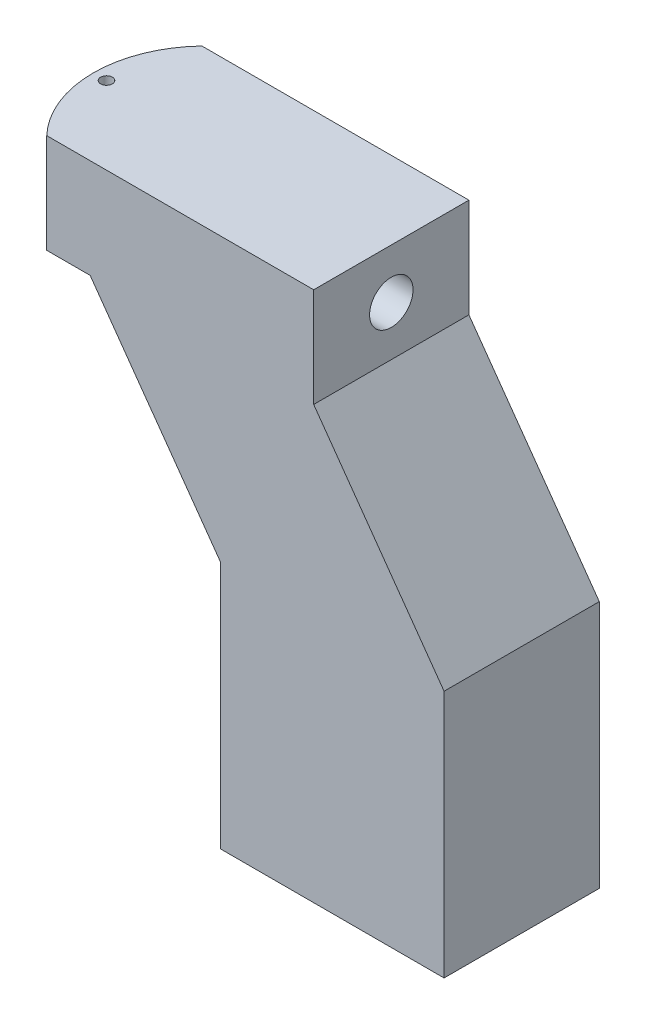
ISO-10303-21;
HEADER;
FILE_DESCRIPTION(('STEP AP214'),'2;1');
FILE_NAME('part.step','',(''),(''),'','','');
FILE_SCHEMA(('AUTOMOTIVE_DESIGN { 1 0 10303 214 1 1 1 1 }'));
ENDSEC;
DATA;
#1=APPLICATION_CONTEXT('core data for automotive mechanical design processes');
#2=APPLICATION_PROTOCOL_DEFINITION('international standard','automotive_design',2000,#1);
#3=PRODUCT_CONTEXT('',#1,'mechanical');
#4=PRODUCT('Part','Part','',(#3));
#5=PRODUCT_RELATED_PRODUCT_CATEGORY('part','',(#4));
#6=PRODUCT_DEFINITION_FORMATION('','',#4);
#7=PRODUCT_DEFINITION_CONTEXT('part definition',#1,'design');
#8=PRODUCT_DEFINITION('design','',#6,#7);
#9=PRODUCT_DEFINITION_SHAPE('','',#8);
#10=(LENGTH_UNIT() NAMED_UNIT(*) SI_UNIT(.MILLI.,.METRE.));
#11=(NAMED_UNIT(*) PLANE_ANGLE_UNIT() SI_UNIT($,.RADIAN.));
#12=(NAMED_UNIT(*) SI_UNIT($,.STERADIAN.) SOLID_ANGLE_UNIT());
#13=UNCERTAINTY_MEASURE_WITH_UNIT(LENGTH_MEASURE(1.E-05),#10,'distance_accuracy_value','');
#14=(GEOMETRIC_REPRESENTATION_CONTEXT(3) GLOBAL_UNCERTAINTY_ASSIGNED_CONTEXT((#13)) GLOBAL_UNIT_ASSIGNED_CONTEXT((#10,
#11,#12)) REPRESENTATION_CONTEXT('',''));
#15=CARTESIAN_POINT('',(0.,0.,0.));
#16=DIRECTION('',(0.,0.,1.));
#17=DIRECTION('',(1.,0.,0.));
#18=AXIS2_PLACEMENT_3D('',#15,#16,#17);
#19=CARTESIAN_POINT('',(0.54102,-21.717,-3.175));
#20=DIRECTION('',(0.,1.,0.));
#21=DIRECTION('',(0.,0.,1.));
#22=AXIS2_PLACEMENT_3D('',#19,#20,#21);
#23=CYLINDRICAL_SURFACE('',#22,0.24003);
#24=CARTESIAN_POINT('',(0.54102,-2.88798282640482,-2.93497));
#25=CARTESIAN_POINT('',(0.554236155346885,-2.88798304927932,-2.93497030590419));
#26=CARTESIAN_POINT('',(0.567455521073122,-2.88829225422702,-2.93606524919866));
#27=CARTESIAN_POINT('',(0.593512028196118,-2.88949184994874,-2.94040751217706));
#28=CARTESIAN_POINT('',(0.606348980940187,-2.89038252276682,-2.94365587640105));
#29=CARTESIAN_POINT('',(0.631259939306122,-2.89263699007009,-2.95219005837392));
#30=CARTESIAN_POINT('',(0.643335007455443,-2.89400010763483,-2.95747296222484));
#31=CARTESIAN_POINT('',(0.666429458001008,-2.89704500716515,-2.96991708587478));
#32=CARTESIAN_POINT('',(0.677448750745898,-2.89872681615643,-2.9770784649922));
#33=CARTESIAN_POINT('',(0.698401386507804,-2.90226792469828,-2.99327262063795));
#34=CARTESIAN_POINT('',(0.708303651502453,-2.90413043388217,-3.00234491370661));
#35=CARTESIAN_POINT('',(0.726466214500858,-2.90779540972771,-3.0220184095594));
#36=CARTESIAN_POINT('',(0.734726338646097,-2.909597870015,-3.03261977402623));
#37=CARTESIAN_POINT('',(0.749500246765532,-2.91297553679467,-3.05526650853636));
#38=CARTESIAN_POINT('',(0.755983058918322,-2.91454651588914,-3.06733276877076));
#39=CARTESIAN_POINT('',(0.766816204961666,-2.91724734234072,-3.09243349359592));
#40=CARTESIAN_POINT('',(0.771166907835945,-2.91837726602017,-3.10546779020797));
#41=CARTESIAN_POINT('',(0.777511537734915,-2.92004597333891,-3.13181012606058));
#42=CARTESIAN_POINT('',(0.779558348415593,-2.92059800029529,-3.14510457444581));
#43=CARTESIAN_POINT('',(0.781403553653398,-2.92109505102219,-3.17185884974813));
#44=CARTESIAN_POINT('',(0.781202333632343,-2.92104017884475,-3.18531864792096));
#45=CARTESIAN_POINT('',(0.778594264958931,-2.92033928485342,-3.21165318185209));
#46=CARTESIAN_POINT('',(0.776244564484611,-2.91970858044684,-3.2245340474229));
#47=CARTESIAN_POINT('',(0.769498656561043,-2.9179450141524,-3.24971138064662));
#48=CARTESIAN_POINT('',(0.765102330965124,-2.91681212327471,-3.26200781451653));
#49=CARTESIAN_POINT('',(0.754344663558499,-2.91414890480294,-3.28581216083852));
#50=CARTESIAN_POINT('',(0.747963896286324,-2.91261467322094,-3.29731083979259));
#51=CARTESIAN_POINT('',(0.733433421680396,-2.90931384178809,-3.31909362003446));
#52=CARTESIAN_POINT('',(0.725283362071803,-2.90754719569001,-3.32937747881501));
#53=CARTESIAN_POINT('',(0.7071429271749,-2.90390720504817,-3.34877982977216));
#54=CARTESIAN_POINT('',(0.697102733973296,-2.90203225223646,-3.3578514977004));
#55=CARTESIAN_POINT('',(0.675624214691467,-2.89843695238078,-3.37419392038059));
#56=CARTESIAN_POINT('',(0.664185798943297,-2.89671661526461,-3.38146455954206));
#57=CARTESIAN_POINT('',(0.640131958131012,-2.89361875050004,-3.39403539250862));
#58=CARTESIAN_POINT('',(0.627509407542544,-2.89224350897601,-3.39932255504969));
#59=CARTESIAN_POINT('',(0.601508114569176,-2.89001979704997,-3.40768424101559));
#60=CARTESIAN_POINT('',(0.588129566095029,-2.88917119223065,-3.41075932907611));
#61=CARTESIAN_POINT('',(0.561434705262119,-2.88812555715638,-3.41452821587451));
#62=CARTESIAN_POINT('',(0.54812901123588,-2.8879093867914,-3.41529198997773));
#63=CARTESIAN_POINT('',(0.521579967359251,-2.88810067493571,-3.41460961402));
#64=CARTESIAN_POINT('',(0.508336610842855,-2.88850806517223,-3.4131637058941));
#65=CARTESIAN_POINT('',(0.482559852530964,-2.88988205482609,-3.40816476297735));
#66=CARTESIAN_POINT('',(0.470017580745107,-2.89083740723587,-3.40465407239828));
#67=CARTESIAN_POINT('',(0.445699968198564,-2.89318862578999,-3.39567297086049));
#68=CARTESIAN_POINT('',(0.433924729687759,-2.89458455052071,-3.39020229925445));
#69=CARTESIAN_POINT('',(0.411183451020988,-2.89769870546514,-3.37731536669439));
#70=CARTESIAN_POINT('',(0.400241524583361,-2.89942347030609,-3.36985816865452));
#71=CARTESIAN_POINT('',(0.379738655464769,-2.90298572524511,-3.35326040337695));
#72=CARTESIAN_POINT('',(0.370177979791198,-2.90482323704058,-3.34411951144191));
#73=CARTESIAN_POINT('',(0.352417058118375,-2.90847004982539,-3.32408965474099));
#74=CARTESIAN_POINT('',(0.344265689332868,-2.91027688931907,-3.31315681088722));
#75=CARTESIAN_POINT('',(0.329913734080422,-2.91360283565777,-3.29003748934709));
#76=CARTESIAN_POINT('',(0.323713043749413,-2.9151219578206,-3.27785107845289));
#77=CARTESIAN_POINT('',(0.31349587668051,-2.91769151060252,-3.25265633361758));
#78=CARTESIAN_POINT('',(0.309463018227467,-2.91874544534803,-3.2396550176376));
#79=CARTESIAN_POINT('',(0.303648866859619,-2.92028130753035,-3.21312643344988));
#80=CARTESIAN_POINT('',(0.301867061453265,-2.92076336516344,-3.19959928568008));
#81=CARTESIAN_POINT('',(0.300638370979028,-2.92109483913859,-3.17285915654959));
#82=CARTESIAN_POINT('',(0.301119873568206,-2.92096365938954,-3.15964966027298));
#83=CARTESIAN_POINT('',(0.304237386803346,-2.92012745551242,-3.1335069641994));
#84=CARTESIAN_POINT('',(0.306873312897095,-2.91942245390449,-3.12057375357979));
#85=CARTESIAN_POINT('',(0.314183953161725,-2.91752184165393,-3.09543919178653));
#86=CARTESIAN_POINT('',(0.318843814343235,-2.91632980888199,-3.08323323194778));
#87=CARTESIAN_POINT('',(0.330056807457022,-2.91357962181077,-3.0597694669318));
#88=CARTESIAN_POINT('',(0.336610210000164,-2.91202141518659,-3.0485117975744));
#89=CARTESIAN_POINT('',(0.351632031656856,-2.9086524415465,-3.02693209952352));
#90=CARTESIAN_POINT('',(0.3601476954816,-2.90683595720231,-3.01664385382845));
#91=CARTESIAN_POINT('',(0.378763144175126,-2.90317779336287,-2.99761817848437));
#92=CARTESIAN_POINT('',(0.388863348763383,-2.90133610731041,-2.98888116104175));
#93=CARTESIAN_POINT('',(0.410637004942681,-2.89778780701891,-2.97300926350235));
#94=CARTESIAN_POINT('',(0.422340968926928,-2.89608520874053,-2.96591526158963));
#95=CARTESIAN_POINT('',(0.446820001192829,-2.89306518411297,-2.95380561677744));
#96=CARTESIAN_POINT('',(0.459594379416334,-2.89174751203666,-2.94878864709603));
#97=CARTESIAN_POINT('',(0.483766750401434,-2.88982461418773,-2.94161323741973));
#98=CARTESIAN_POINT('',(0.495062410982024,-2.88913961625142,-2.93912796319939));
#99=CARTESIAN_POINT('',(0.517911250446445,-2.88821865203579,-2.93580631031179));
#100=CARTESIAN_POINT('',(0.529464398063099,-2.88798263153355,-2.93496973253136));
#101=CARTESIAN_POINT('',(0.54102,-2.88798282640482,-2.93497));
#102=B_SPLINE_CURVE_WITH_KNOTS('',3,(#24,#25,#26,#27,#28,#29,#30,#31,#32,#33,#34,#35,#36,#37,
#38,#39,#40,#41,#42,#43,#44,#45,#46,#47,#48,#49,#50,#51,#52,#53,#54,#55,#56,#57,#58,#59,#60,#61,
#62,#63,#64,#65,#66,#67,#68,#69,#70,#71,#72,#73,#74,#75,#76,#77,#78,#79,#80,#81,#82,#83,#84,#85,
#86,#87,#88,#89,#90,#91,#92,#93,#94,#95,#96,#97,#98,#99,#100,#101),.UNSPECIFIED.,.T.,.F.,(4,2,2,
2,2,2,2,2,2,2,2,2,2,2,2,2,2,2,2,2,2,2,2,2,2,2,2,2,2,2,2,2,2,2,2,2,2,2,4),(0.,0.0396059620935172,
0.0792311495569324,0.118799795032823,0.158371797514894,0.198860704906883,0.239353896704178,
0.280513388415694,0.321665754530682,0.361852911757495,0.402033179056405,0.441174818753102,
0.480318718281323,0.519858540090494,0.559406241705615,0.600197755160072,0.640991885946086,
0.682049522542666,0.723096675387109,0.762888023024411,0.802675014274361,0.841673189095263,
0.88067655199966,0.92055590377599,0.960442954281112,1.00151545838151,1.04258577520202,
1.08334120896987,1.12408736237818,1.16355312182914,1.2030173324866,1.242196696428,
1.28138166236484,1.32163257829637,1.36189417410894,1.40306986059721,1.44421920384151,
1.47885302912955,1.51348267143233),.UNSPECIFIED.);
#103=CARTESIAN_POINT('',(0.54102,-2.88798282640482,-2.93497));
#104=VERTEX_POINT('',#103);
#105=EDGE_CURVE('E193',#104,#104,#102,.T.);
#106=ORIENTED_EDGE('',*,*,#105,.T.);
#107=EDGE_LOOP('',(#106));
#108=FACE_BOUND('',#107,.T.);
#109=CARTESIAN_POINT('',(0.54102,-4.064,-3.175));
#110=DIRECTION('',(0.,-1.,0.));
#111=DIRECTION('',(0.,0.,-1.));
#112=AXIS2_PLACEMENT_3D('',#109,#110,#111);
#113=CIRCLE('',#112,0.24003);
#114=CARTESIAN_POINT('',(0.54102,-4.064,-3.41503));
#115=VERTEX_POINT('',#114);
#116=EDGE_CURVE('E183',#115,#115,#113,.T.);
#117=ORIENTED_EDGE('',*,*,#116,.T.);
#118=EDGE_LOOP('',(#117));
#119=FACE_BOUND('',#118,.T.);
#120=ADVANCED_FACE('F41',(#108,#119),#23,.F.);
#121=CARTESIAN_POINT('',(0.,0.,-6.35));
#122=DIRECTION('',(0.,1.,0.));
#123=DIRECTION('',(0.,0.,1.));
#124=AXIS2_PLACEMENT_3D('',#121,#122,#123);
#125=PLANE('',#124);
#126=CARTESIAN_POINT('',(0.54102,0.,-3.175));
#127=DIRECTION('',(0.,1.,0.));
#128=DIRECTION('',(0.,0.,1.));
#129=AXIS2_PLACEMENT_3D('',#126,#127,#128);
#130=CIRCLE('',#129,0.24003);
#131=CARTESIAN_POINT('',(0.54102,0.,-2.93497));
#132=VERTEX_POINT('',#131);
#133=EDGE_CURVE('E186',#132,#132,#130,.T.);
#134=ORIENTED_EDGE('',*,*,#133,.F.);
#135=EDGE_LOOP('',(#134));
#136=FACE_BOUND('',#135,.T.);
#137=CARTESIAN_POINT('',(4.60375,0.,-3.175));
#138=DIRECTION('',(0.,-1.,0.));
#139=DIRECTION('',(0.,0.,1.));
#140=AXIS2_PLACEMENT_3D('',#137,#138,#139);
#141=CIRCLE('',#140,4.60375);
#142=CARTESIAN_POINT('',(1.27,0.,0.));
#143=VERTEX_POINT('',#142);
#144=CARTESIAN_POINT('',(1.27,0.,-6.35));
#145=VERTEX_POINT('',#144);
#146=EDGE_CURVE('E207',#143,#145,#141,.T.);
#147=ORIENTED_EDGE('',*,*,#146,.F.);
#148=DIRECTION('',(-1.,0.,0.));
#149=VECTOR('',#148,1.);
#150=CARTESIAN_POINT('',(0.,0.,0.));
#151=LINE('',#150,#149);
#152=CARTESIAN_POINT('',(12.192,0.,0.));
#153=VERTEX_POINT('',#152);
#154=EDGE_CURVE('E172',#153,#143,#151,.T.);
#155=ORIENTED_EDGE('',*,*,#154,.F.);
#156=DIRECTION('',(0.,0.,1.));
#157=VECTOR('',#156,1.);
#158=CARTESIAN_POINT('',(12.192,0.,-6.35));
#159=LINE('',#158,#157);
#160=CARTESIAN_POINT('',(12.192,0.,-6.35));
#161=VERTEX_POINT('',#160);
#162=EDGE_CURVE('E70',#161,#153,#159,.T.);
#163=ORIENTED_EDGE('',*,*,#162,.F.);
#164=DIRECTION('',(-1.,0.,0.));
#165=VECTOR('',#164,1.);
#166=CARTESIAN_POINT('',(0.,0.,-6.35));
#167=LINE('',#166,#165);
#168=EDGE_CURVE('E153',#161,#145,#167,.T.);
#169=ORIENTED_EDGE('',*,*,#168,.T.);
#170=EDGE_LOOP('',(#147,#155,#163,#169));
#171=FACE_BOUND('',#170,.T.);
#172=ADVANCED_FACE('F235',(#136,#171),#125,.T.);
#173=CARTESIAN_POINT('',(12.192,0.,-6.35));
#174=DIRECTION('',(1.,0.,0.));
#175=DIRECTION('',(0.,0.,-1.));
#176=AXIS2_PLACEMENT_3D('',#173,#174,#175);
#177=PLANE('',#176);
#178=CARTESIAN_POINT('',(12.192,-2.032,-3.175));
#179=DIRECTION('',(1.,0.,0.));
#180=DIRECTION('',(0.,0.,-1.));
#181=AXIS2_PLACEMENT_3D('',#178,#179,#180);
#182=CIRCLE('',#181,0.888999999999987);
#183=CARTESIAN_POINT('',(12.192,-2.032,-4.06399999999999));
#184=VERTEX_POINT('',#183);
#185=EDGE_CURVE('E294',#184,#184,#182,.T.);
#186=ORIENTED_EDGE('',*,*,#185,.F.);
#187=EDGE_LOOP('',(#186));
#188=FACE_BOUND('',#187,.T.);
#189=DIRECTION('',(0.,1.,0.));
#190=VECTOR('',#189,1.);
#191=CARTESIAN_POINT('',(12.192,0.,0.));
#192=LINE('',#191,#190);
#193=CARTESIAN_POINT('',(12.192,-4.064,0.));
#194=VERTEX_POINT('',#193);
#195=EDGE_CURVE('E170',#194,#153,#192,.T.);
#196=ORIENTED_EDGE('',*,*,#195,.F.);
#197=DIRECTION('',(0.,0.,1.));
#198=VECTOR('',#197,1.);
#199=CARTESIAN_POINT('',(12.192,-4.064,-6.35));
#200=LINE('',#199,#198);
#201=CARTESIAN_POINT('',(12.192,-4.064,-6.35));
#202=VERTEX_POINT('',#201);
#203=EDGE_CURVE('E132',#202,#194,#200,.T.);
#204=ORIENTED_EDGE('',*,*,#203,.F.);
#205=DIRECTION('',(0.,1.,0.));
#206=VECTOR('',#205,1.);
#207=CARTESIAN_POINT('',(12.192,0.,-6.35));
#208=LINE('',#207,#206);
#209=EDGE_CURVE('E143',#202,#161,#208,.T.);
#210=ORIENTED_EDGE('',*,*,#209,.T.);
#211=ORIENTED_EDGE('',*,*,#162,.T.);
#212=EDGE_LOOP('',(#196,#204,#210,#211));
#213=FACE_BOUND('',#212,.T.);
#214=ADVANCED_FACE('F238',(#188,#213),#177,.T.);
#215=CARTESIAN_POINT('',(12.192,-4.064,-6.35));
#216=DIRECTION('',(0.814665388332884,0.579931293389511,0.));
#217=DIRECTION('',(-0.579931293389511,0.814665388332884,0.));
#218=AXIS2_PLACEMENT_3D('',#215,#216,#217);
#219=PLANE('',#218);
#220=DIRECTION('',(-0.579931293389511,0.814665388332884,0.));
#221=VECTOR('',#220,1.);
#222=CARTESIAN_POINT('',(12.192,-4.064,0.));
#223=LINE('',#222,#221);
#224=CARTESIAN_POINT('',(17.526,-11.557,0.));
#225=VERTEX_POINT('',#224);
#226=EDGE_CURVE('E127',#225,#194,#223,.T.);
#227=ORIENTED_EDGE('',*,*,#226,.F.);
#228=DIRECTION('',(0.,0.,1.));
#229=VECTOR('',#228,1.);
#230=CARTESIAN_POINT('',(17.526,-11.557,-6.35));
#231=LINE('',#230,#229);
#232=CARTESIAN_POINT('',(17.526,-11.557,-6.35));
#233=VERTEX_POINT('',#232);
#234=EDGE_CURVE('E122',#233,#225,#231,.T.);
#235=ORIENTED_EDGE('',*,*,#234,.F.);
#236=DIRECTION('',(-0.579931293389511,0.814665388332884,0.));
#237=VECTOR('',#236,1.);
#238=CARTESIAN_POINT('',(12.192,-4.064,-6.35));
#239=LINE('',#238,#237);
#240=EDGE_CURVE('E125',#233,#202,#239,.T.);
#241=ORIENTED_EDGE('',*,*,#240,.T.);
#242=ORIENTED_EDGE('',*,*,#203,.T.);
#243=EDGE_LOOP('',(#227,#235,#241,#242));
#244=FACE_BOUND('',#243,.T.);
#245=ADVANCED_FACE('F124',(#244),#219,.T.);
#246=CARTESIAN_POINT('',(17.526,-11.557,-6.35));
#247=DIRECTION('',(1.,0.,0.));
#248=DIRECTION('',(0.,0.,-1.));
#249=AXIS2_PLACEMENT_3D('',#246,#247,#248);
#250=PLANE('',#249);
#251=DIRECTION('',(0.,1.,0.));
#252=VECTOR('',#251,1.);
#253=CARTESIAN_POINT('',(17.526,-11.557,0.));
#254=LINE('',#253,#252);
#255=CARTESIAN_POINT('',(17.526,-21.717,0.));
#256=VERTEX_POINT('',#255);
#257=EDGE_CURVE('E167',#256,#225,#254,.T.);
#258=ORIENTED_EDGE('',*,*,#257,.F.);
#259=DIRECTION('',(0.,0.,1.));
#260=VECTOR('',#259,1.);
#261=CARTESIAN_POINT('',(17.526,-21.717,-6.35));
#262=LINE('',#261,#260);
#263=CARTESIAN_POINT('',(17.526,-21.717,-6.35));
#264=VERTEX_POINT('',#263);
#265=EDGE_CURVE('E133',#264,#256,#262,.T.);
#266=ORIENTED_EDGE('',*,*,#265,.F.);
#267=DIRECTION('',(0.,1.,0.));
#268=VECTOR('',#267,1.);
#269=CARTESIAN_POINT('',(17.526,-11.557,-6.35));
#270=LINE('',#269,#268);
#271=EDGE_CURVE('E140',#264,#233,#270,.T.);
#272=ORIENTED_EDGE('',*,*,#271,.T.);
#273=ORIENTED_EDGE('',*,*,#234,.T.);
#274=EDGE_LOOP('',(#258,#266,#272,#273));
#275=FACE_BOUND('',#274,.T.);
#276=ADVANCED_FACE('F145',(#275),#250,.T.);
#277=CARTESIAN_POINT('',(8.382,-21.717,-6.35));
#278=DIRECTION('',(0.,-1.,0.));
#279=DIRECTION('',(0.,0.,-1.));
#280=AXIS2_PLACEMENT_3D('',#277,#278,#279);
#281=PLANE('',#280);
#282=CARTESIAN_POINT('',(12.954,-21.717,-3.175));
#283=DIRECTION('',(0.,-1.,0.));
#284=DIRECTION('',(0.,0.,-1.));
#285=AXIS2_PLACEMENT_3D('',#282,#283,#284);
#286=CIRCLE('',#285,1.5875);
#287=CARTESIAN_POINT('',(12.954,-21.717,-4.7625));
#288=VERTEX_POINT('',#287);
#289=EDGE_CURVE('E185',#288,#288,#286,.T.);
#290=ORIENTED_EDGE('',*,*,#289,.F.);
#291=EDGE_LOOP('',(#290));
#292=FACE_BOUND('',#291,.T.);
#293=DIRECTION('',(1.,0.,0.));
#294=VECTOR('',#293,1.);
#295=CARTESIAN_POINT('',(8.382,-21.717,0.));
#296=LINE('',#295,#294);
#297=CARTESIAN_POINT('',(8.382,-21.717,0.));
#298=VERTEX_POINT('',#297);
#299=EDGE_CURVE('E164',#298,#256,#296,.T.);
#300=ORIENTED_EDGE('',*,*,#299,.F.);
#301=DIRECTION('',(0.,0.,1.));
#302=VECTOR('',#301,1.);
#303=CARTESIAN_POINT('',(8.382,-21.717,-6.35));
#304=LINE('',#303,#302);
#305=CARTESIAN_POINT('',(8.382,-21.717,-6.35));
#306=VERTEX_POINT('',#305);
#307=EDGE_CURVE('E178',#306,#298,#304,.T.);
#308=ORIENTED_EDGE('',*,*,#307,.F.);
#309=DIRECTION('',(1.,0.,0.));
#310=VECTOR('',#309,1.);
#311=CARTESIAN_POINT('',(8.382,-21.717,-6.35));
#312=LINE('',#311,#310);
#313=EDGE_CURVE('E146',#306,#264,#312,.T.);
#314=ORIENTED_EDGE('',*,*,#313,.T.);
#315=ORIENTED_EDGE('',*,*,#265,.T.);
#316=EDGE_LOOP('',(#300,#308,#314,#315));
#317=FACE_BOUND('',#316,.T.);
#318=ADVANCED_FACE('F256',(#292,#317),#281,.T.);
#319=CARTESIAN_POINT('',(8.382,-11.557,-6.35));
#320=DIRECTION('',(-1.,0.,0.));
#321=DIRECTION('',(0.,-1.,0.));
#322=AXIS2_PLACEMENT_3D('',#319,#320,#321);
#323=PLANE('',#322);
#324=DIRECTION('',(0.,-1.,0.));
#325=VECTOR('',#324,1.);
#326=CARTESIAN_POINT('',(8.382,-11.557,0.));
#327=LINE('',#326,#325);
#328=CARTESIAN_POINT('',(8.382,-11.557,0.));
#329=VERTEX_POINT('',#328);
#330=EDGE_CURVE('E161',#329,#298,#327,.T.);
#331=ORIENTED_EDGE('',*,*,#330,.F.);
#332=DIRECTION('',(0.,0.,1.));
#333=VECTOR('',#332,1.);
#334=CARTESIAN_POINT('',(8.382,-11.557,-6.35));
#335=LINE('',#334,#333);
#336=CARTESIAN_POINT('',(8.382,-11.557,-6.35));
#337=VERTEX_POINT('',#336);
#338=EDGE_CURVE('E180',#337,#329,#335,.T.);
#339=ORIENTED_EDGE('',*,*,#338,.F.);
#340=DIRECTION('',(0.,-1.,0.));
#341=VECTOR('',#340,1.);
#342=CARTESIAN_POINT('',(8.382,-11.557,-6.35));
#343=LINE('',#342,#341);
#344=EDGE_CURVE('E148',#337,#306,#343,.T.);
#345=ORIENTED_EDGE('',*,*,#344,.T.);
#346=ORIENTED_EDGE('',*,*,#307,.T.);
#347=EDGE_LOOP('',(#331,#339,#345,#346));
#348=FACE_BOUND('',#347,.T.);
#349=ADVANCED_FACE('F222',(#348),#323,.T.);
#350=CARTESIAN_POINT('',(3.048,-4.064,-6.35));
#351=DIRECTION('',(-0.814665388332884,-0.579931293389511,0.));
#352=DIRECTION('',(0.579931293389511,-0.814665388332884,0.));
#353=AXIS2_PLACEMENT_3D('',#350,#351,#352);
#354=PLANE('',#353);
#355=DIRECTION('',(0.579931293389511,-0.814665388332884,0.));
#356=VECTOR('',#355,1.);
#357=CARTESIAN_POINT('',(3.048,-4.064,0.));
#358=LINE('',#357,#356);
#359=CARTESIAN_POINT('',(3.048,-4.064,0.));
#360=VERTEX_POINT('',#359);
#361=EDGE_CURVE('E158',#360,#329,#358,.T.);
#362=ORIENTED_EDGE('',*,*,#361,.F.);
#363=DIRECTION('',(0.,0.,1.));
#364=VECTOR('',#363,1.);
#365=CARTESIAN_POINT('',(3.048,-4.064,-6.35));
#366=LINE('',#365,#364);
#367=CARTESIAN_POINT('',(3.048,-4.064,-6.35));
#368=VERTEX_POINT('',#367);
#369=EDGE_CURVE('E155',#368,#360,#366,.T.);
#370=ORIENTED_EDGE('',*,*,#369,.F.);
#371=DIRECTION('',(0.579931293389511,-0.814665388332884,0.));
#372=VECTOR('',#371,1.);
#373=CARTESIAN_POINT('',(3.048,-4.064,-6.35));
#374=LINE('',#373,#372);
#375=EDGE_CURVE('E216',#368,#337,#374,.T.);
#376=ORIENTED_EDGE('',*,*,#375,.T.);
#377=ORIENTED_EDGE('',*,*,#338,.T.);
#378=EDGE_LOOP('',(#362,#370,#376,#377));
#379=FACE_BOUND('',#378,.T.);
#380=ADVANCED_FACE('F227',(#379),#354,.T.);
#381=CARTESIAN_POINT('',(0.,-4.064,-6.35));
#382=DIRECTION('',(0.,-1.,0.));
#383=DIRECTION('',(0.,0.,-1.));
#384=AXIS2_PLACEMENT_3D('',#381,#382,#383);
#385=PLANE('',#384);
#386=ORIENTED_EDGE('',*,*,#116,.F.);
#387=EDGE_LOOP('',(#386));
#388=FACE_BOUND('',#387,.T.);
#389=CARTESIAN_POINT('',(4.60375,-4.064,-3.175));
#390=DIRECTION('',(0.,-1.,0.));
#391=DIRECTION('',(0.,0.,-1.));
#392=AXIS2_PLACEMENT_3D('',#389,#390,#391);
#393=CIRCLE('',#392,4.60375);
#394=CARTESIAN_POINT('',(1.27,-4.064,-6.35));
#395=VERTEX_POINT('',#394);
#396=CARTESIAN_POINT('',(1.27,-4.064,0.));
#397=VERTEX_POINT('',#396);
#398=EDGE_CURVE('E61',#395,#397,#393,.F.);
#399=ORIENTED_EDGE('',*,*,#398,.F.);
#400=DIRECTION('',(1.,0.,0.));
#401=VECTOR('',#400,1.);
#402=CARTESIAN_POINT('',(0.,-4.064,-6.35));
#403=LINE('',#402,#401);
#404=EDGE_CURVE('E106',#395,#368,#403,.T.);
#405=ORIENTED_EDGE('',*,*,#404,.T.);
#406=ORIENTED_EDGE('',*,*,#369,.T.);
#407=DIRECTION('',(1.,0.,0.));
#408=VECTOR('',#407,1.);
#409=CARTESIAN_POINT('',(0.,-4.064,0.));
#410=LINE('',#409,#408);
#411=EDGE_CURVE('E156',#397,#360,#410,.T.);
#412=ORIENTED_EDGE('',*,*,#411,.F.);
#413=EDGE_LOOP('',(#399,#405,#406,#412));
#414=FACE_BOUND('',#413,.T.);
#415=ADVANCED_FACE('F43',(#388,#414),#385,.T.);
#416=CARTESIAN_POINT('',(0.,0.,-6.35));
#417=DIRECTION('',(0.,0.,1.));
#418=DIRECTION('',(1.,0.,0.));
#419=AXIS2_PLACEMENT_3D('',#416,#417,#418);
#420=PLANE('',#419);
#421=ORIENTED_EDGE('',*,*,#404,.F.);
#422=DIRECTION('',(0.,1.,0.));
#423=VECTOR('',#422,1.);
#424=CARTESIAN_POINT('',(1.27,-6.35,-6.35));
#425=LINE('',#424,#423);
#426=EDGE_CURVE('E211',#395,#145,#425,.T.);
#427=ORIENTED_EDGE('',*,*,#426,.T.);
#428=ORIENTED_EDGE('',*,*,#168,.F.);
#429=ORIENTED_EDGE('',*,*,#209,.F.);
#430=ORIENTED_EDGE('',*,*,#240,.F.);
#431=ORIENTED_EDGE('',*,*,#271,.F.);
#432=ORIENTED_EDGE('',*,*,#313,.F.);
#433=ORIENTED_EDGE('',*,*,#344,.F.);
#434=ORIENTED_EDGE('',*,*,#375,.F.);
#435=EDGE_LOOP('',(#421,#427,#428,#429,#430,#431,#432,#433,#434));
#436=FACE_BOUND('',#435,.T.);
#437=ADVANCED_FACE('F138',(#436),#420,.F.);
#438=CARTESIAN_POINT('',(0.,0.,0.));
#439=DIRECTION('',(0.,0.,1.));
#440=DIRECTION('',(1.,0.,0.));
#441=AXIS2_PLACEMENT_3D('',#438,#439,#440);
#442=PLANE('',#441);
#443=DIRECTION('',(0.,1.,0.));
#444=VECTOR('',#443,1.);
#445=CARTESIAN_POINT('',(1.27,-6.35,0.));
#446=LINE('',#445,#444);
#447=EDGE_CURVE('E54',#397,#143,#446,.T.);
#448=ORIENTED_EDGE('',*,*,#447,.F.);
#449=ORIENTED_EDGE('',*,*,#411,.T.);
#450=ORIENTED_EDGE('',*,*,#361,.T.);
#451=ORIENTED_EDGE('',*,*,#330,.T.);
#452=ORIENTED_EDGE('',*,*,#299,.T.);
#453=ORIENTED_EDGE('',*,*,#257,.T.);
#454=ORIENTED_EDGE('',*,*,#226,.T.);
#455=ORIENTED_EDGE('',*,*,#195,.T.);
#456=ORIENTED_EDGE('',*,*,#154,.T.);
#457=EDGE_LOOP('',(#448,#449,#450,#451,#452,#453,#454,#455,#456));
#458=FACE_BOUND('',#457,.T.);
#459=ADVANCED_FACE('F230',(#458),#442,.T.);
#460=CARTESIAN_POINT('',(4.60375,-6.35,-3.175));
#461=DIRECTION('',(0.,1.,0.));
#462=DIRECTION('',(0.,0.,1.));
#463=AXIS2_PLACEMENT_3D('',#460,#461,#462);
#464=CYLINDRICAL_SURFACE('',#463,4.60375);
#465=CARTESIAN_POINT('',(0.,-1.14300000000001,-3.175));
#466=CARTESIAN_POINT('',(9.03825509764068E-07,-1.14300185921094,-3.12555686759958));
#467=CARTESIAN_POINT('',(0.000804712844058094,-1.14713872414975,-3.07608985142904));
#468=CARTESIAN_POINT('',(0.00393376570185346,-1.1635651324436,-2.9785516566436));
#469=CARTESIAN_POINT('',(0.00626026036585508,-1.17586137851583,-2.93048165955856));
#470=CARTESIAN_POINT('',(0.0121746398316704,-1.208214468113,-2.83716205610778));
#471=CARTESIAN_POINT('',(0.0157613546613745,-1.22826411521185,-2.79190987943032));
#472=CARTESIAN_POINT('',(0.0238052840072946,-1.27553401706977,-2.70541542768675));
#473=CARTESIAN_POINT('',(0.0282624362985126,-1.30275375930844,-2.6641728663006));
#474=CARTESIAN_POINT('',(0.0376190294489412,-1.36395699453045,-2.58634222198827));
#475=CARTESIAN_POINT('',(0.0425229151243592,-1.39801373195745,-2.54981226434192));
#476=CARTESIAN_POINT('',(0.0521875761473302,-1.47176669920776,-2.48294682320232));
#477=CARTESIAN_POINT('',(0.0569483408044532,-1.51146334904271,-2.45261180146447));
#478=CARTESIAN_POINT('',(0.0658310176998225,-1.59578331013612,-2.39875308149554));
#479=CARTESIAN_POINT('',(0.0699472041723755,-1.64044534345787,-2.37528897799283));
#480=CARTESIAN_POINT('',(0.0770118239287804,-1.73317037928777,-2.33621978009266));
#481=CARTESIAN_POINT('',(0.0799603643344163,-1.78123306933699,-2.32061396472714));
#482=CARTESIAN_POINT('',(0.084311005381382,-1.87877162838901,-2.29789183156377));
#483=CARTESIAN_POINT('',(0.0857316049467589,-1.92822297793148,-2.29067387300423));
#484=CARTESIAN_POINT('',(0.0869212505670122,-2.02765363806473,-2.28461676095283));
#485=CARTESIAN_POINT('',(0.0866904538442108,-2.07763289794308,-2.28577680982708));
#486=CARTESIAN_POINT('',(0.0846202110895286,-2.17596109106885,-2.29636047141262));
#487=CARTESIAN_POINT('',(0.0828033455572953,-2.22432305497661,-2.30566809405996));
#488=CARTESIAN_POINT('',(0.0778011861042186,-2.31878586881629,-2.33209984247071));
#489=CARTESIAN_POINT('',(0.0746158308485337,-2.36488661729877,-2.34922431858268));
#490=CARTESIAN_POINT('',(0.0672122251372849,-2.45385549555922,-2.39091592289405));
#491=CARTESIAN_POINT('',(0.0629875600685438,-2.49670130019641,-2.41552950618953));
#492=CARTESIAN_POINT('',(0.0539855347693074,-2.57769820632132,-2.47146781529415));
#493=CARTESIAN_POINT('',(0.0492081151906894,-2.61584880278494,-2.50279326205053));
#494=CARTESIAN_POINT('',(0.0395407349711446,-2.68704211605134,-2.571889538554));
#495=CARTESIAN_POINT('',(0.0346502291493801,-2.71998863721338,-2.60975948481534));
#496=CARTESIAN_POINT('',(0.0253810920980094,-2.77907616204492,-2.69053911862926));
#497=CARTESIAN_POINT('',(0.021002466609201,-2.80521708939293,-2.73344886269296));
#498=CARTESIAN_POINT('',(0.0132407772259293,-2.84996714611955,-2.82319325313539));
#499=CARTESIAN_POINT('',(0.00985909527432369,-2.86856583387769,-2.87003323313903));
#500=CARTESIAN_POINT('',(0.004482907837184,-2.89760387121211,-2.96625255134373));
#501=CARTESIAN_POINT('',(0.00248824590191762,-2.90804414103835,-3.01563160247379));
#502=CARTESIAN_POINT('',(0.000132464204751669,-2.92033407573461,-3.11470019172897));
#503=CARTESIAN_POINT('',(-0.00025370284927437,-2.92231547342524,-3.16437281105815));
#504=CARTESIAN_POINT('',(0.000581658719856958,-2.91798540204526,-3.26333947771679));
#505=CARTESIAN_POINT('',(0.00180310335412101,-2.91167436620884,-3.31263354468822));
#506=CARTESIAN_POINT('',(0.00570081450742944,-2.89104806468521,-3.40902284305896));
#507=CARTESIAN_POINT('',(0.00836488559146829,-2.87679986824755,-3.45613296283827));
#508=CARTESIAN_POINT('',(0.0148503104744665,-2.84077659177314,-3.54729560321247));
#509=CARTESIAN_POINT('',(0.0186717465006046,-2.8190009769212,-3.59134790628557));
#510=CARTESIAN_POINT('',(0.0271104635187091,-2.76825233322832,-3.67570371275092));
#511=CARTESIAN_POINT('',(0.031736400016051,-2.73919933190908,-3.71595822067957));
#512=CARTESIAN_POINT('',(0.0412495483675887,-2.6748283374358,-3.7910678343835));
#513=CARTESIAN_POINT('',(0.0461367861719342,-2.63950972122555,-3.82592240253948));
#514=CARTESIAN_POINT('',(0.0557054003876687,-2.5630121999119,-3.88974677885966));
#515=CARTESIAN_POINT('',(0.0603828907566511,-2.52175752003508,-3.91862644744885));
#516=CARTESIAN_POINT('',(0.0689224144618478,-2.43490516223081,-3.96904625365375));
#517=CARTESIAN_POINT('',(0.0727844791846151,-2.38930765156137,-3.9905866737841));
#518=CARTESIAN_POINT('',(0.0792249858018439,-2.295286145673,-4.02559080964257));
#519=CARTESIAN_POINT('',(0.0818098202238748,-2.24687761009588,-4.03909481848506));
#520=CARTESIAN_POINT('',(0.0854173481939038,-2.14842378205134,-4.05776619136124));
#521=CARTESIAN_POINT('',(0.0864402299885478,-2.0983786875648,-4.06293456001112));
#522=CARTESIAN_POINT('',(0.0867980898312137,-1.9989761549306,-4.06475274600234));
#523=CARTESIAN_POINT('',(0.0861612627387514,-1.94962136537982,-4.06154485607924));
#524=CARTESIAN_POINT('',(0.0833341883827269,-1.85216885275038,-4.04701422177218));
#525=CARTESIAN_POINT('',(0.0811439517684777,-1.80407112105638,-4.03569153301877));
#526=CARTESIAN_POINT('',(0.0754690414696088,-1.71058075762178,-4.00531427731989));
#527=CARTESIAN_POINT('',(0.0719870995528422,-1.66518265000357,-3.98627601987478));
#528=CARTESIAN_POINT('',(0.0641193430804508,-1.57820244631719,-3.9410239452355));
#529=CARTESIAN_POINT('',(0.0597334593648284,-1.53662064258397,-3.91480957895152));
#530=CARTESIAN_POINT('',(0.0504650271466653,-1.45774248650601,-3.85545855304039));
#531=CARTESIAN_POINT('',(0.0455757038719162,-1.42052457487508,-3.82221868459439));
#532=CARTESIAN_POINT('',(0.0359010630539413,-1.35214750321011,-3.74997450723533));
#533=CARTESIAN_POINT('',(0.0311157696575117,-1.32098973676115,-3.71096887605396));
#534=CARTESIAN_POINT('',(0.0221341271712028,-1.26533546426199,-3.62784932072181));
#535=CARTESIAN_POINT('',(0.0179438993439181,-1.24090605911622,-3.58368978287818));
#536=CARTESIAN_POINT('',(0.0106844784504822,-1.19985273958624,-3.49182521298625));
#537=CARTESIAN_POINT('',(0.00761425167052727,-1.18322162364213,-3.44412349941808));
#538=CARTESIAN_POINT('',(0.00355375608131052,-1.16154534687755,-3.35941322166928));
#539=CARTESIAN_POINT('',(0.00222874329515616,-1.15460295198633,-3.32289430614618));
#540=CARTESIAN_POINT('',(0.000451538132680105,-1.14532964528153,-3.24925473981855));
#541=CARTESIAN_POINT('',(-6.78815249781455E-07,-1.1429986036456,-3.21213410598372));
#542=CARTESIAN_POINT('',(0.,-1.14300000000001,-3.175));
#543=B_SPLINE_CURVE_WITH_KNOTS('',3,(#465,#466,#467,#468,#469,#470,#471,#472,#473,#474,#475,
#476,#477,#478,#479,#480,#481,#482,#483,#484,#485,#486,#487,#488,#489,#490,#491,#492,#493,#494,
#495,#496,#497,#498,#499,#500,#501,#502,#503,#504,#505,#506,#507,#508,#509,#510,#511,#512,#513,
#514,#515,#516,#517,#518,#519,#520,#521,#522,#523,#524,#525,#526,#527,#528,#529,#530,#531,#532,
#533,#534,#535,#536,#537,#538,#539,#540,#541,#542),.UNSPECIFIED.,.T.,.F.,(4,2,2,2,2,2,2,2,2,2,2,
2,2,2,2,2,2,2,2,2,2,2,2,2,2,2,2,2,2,2,2,2,2,2,2,2,2,2,4),(0.,0.148193575331336,
0.296509038747163,0.444687170254872,0.59285471282152,0.742703532401621,0.892563517273968,
1.04368722120652,1.1947970575865,1.34405605449364,1.49330084128414,1.64045489138663,
1.78761553752848,1.9357083066192,2.08381699090907,2.23440498871359,2.38499467521815,
2.53579213502028,2.68657258277461,2.83499610971168,2.98341188264133,3.13059215565048,
3.27778288781413,3.42666811676382,3.5755681592503,3.72657278705219,3.87757160147408,
4.02780681337857,4.17802391749479,4.325705856733,4.47338678355564,4.62075715096794,
4.76813879777935,4.91785828525813,5.06761216148367,5.21880947691125,5.36986688838604,
5.48117033130185,5.5924706406733),.UNSPECIFIED.);
#544=CARTESIAN_POINT('',(0.,-1.14300000000001,-3.175));
#545=VERTEX_POINT('',#544);
#546=EDGE_CURVE('E11',#545,#545,#543,.T.);
#547=ORIENTED_EDGE('',*,*,#546,.T.);
#548=EDGE_LOOP('',(#547));
#549=FACE_BOUND('',#548,.T.);
#550=ORIENTED_EDGE('',*,*,#146,.T.);
#551=ORIENTED_EDGE('',*,*,#426,.F.);
#552=ORIENTED_EDGE('',*,*,#398,.T.);
#553=ORIENTED_EDGE('',*,*,#447,.T.);
#554=EDGE_LOOP('',(#550,#551,#552,#553));
#555=FACE_BOUND('',#554,.T.);
#556=ADVANCED_FACE('F233',(#549,#555),#464,.T.);
#557=CARTESIAN_POINT('',(12.954,-14.097,-3.175));
#558=DIRECTION('',(0.,-1.,0.));
#559=DIRECTION('',(0.,0.,-1.));
#560=AXIS2_PLACEMENT_3D('',#557,#558,#559);
#561=CYLINDRICAL_SURFACE('',#560,1.5875);
#562=CARTESIAN_POINT('',(12.954,-14.097,-3.175));
#563=DIRECTION('',(0.,-1.,0.));
#564=DIRECTION('',(0.,0.,-1.));
#565=AXIS2_PLACEMENT_3D('',#562,#563,#564);
#566=CIRCLE('',#565,1.5875);
#567=CARTESIAN_POINT('',(12.954,-14.097,-4.7625));
#568=VERTEX_POINT('',#567);
#569=EDGE_CURVE('E190',#568,#568,#566,.T.);
#570=ORIENTED_EDGE('',*,*,#569,.F.);
#571=EDGE_LOOP('',(#570));
#572=FACE_BOUND('',#571,.T.);
#573=ORIENTED_EDGE('',*,*,#289,.T.);
#574=EDGE_LOOP('',(#573));
#575=FACE_BOUND('',#574,.T.);
#576=ADVANCED_FACE('F275',(#572,#575),#561,.F.);
#577=CARTESIAN_POINT('',(12.954,-14.097,-3.175));
#578=DIRECTION('',(0.,-1.,0.));
#579=DIRECTION('',(0.,0.,-1.));
#580=AXIS2_PLACEMENT_3D('',#577,#578,#579);
#581=PLANE('',#580);
#582=ORIENTED_EDGE('',*,*,#569,.T.);
#583=EDGE_LOOP('',(#582));
#584=FACE_BOUND('',#583,.T.);
#585=ADVANCED_FACE('F279',(#584),#581,.T.);
#586=CARTESIAN_POINT('',(0.54102,-1.17601717359518,-2.93497));
#587=CARTESIAN_POINT('',(0.527803844653116,-1.17601695072068,-2.93497030590419));
#588=CARTESIAN_POINT('',(0.514584478926878,-1.17570774577298,-2.93606524919866));
#589=CARTESIAN_POINT('',(0.488527971803883,-1.17450815005126,-2.94040751217706));
#590=CARTESIAN_POINT('',(0.475691019059814,-1.17361747723317,-2.94365587640105));
#591=CARTESIAN_POINT('',(0.45078006069388,-1.17136300992991,-2.95219005837392));
#592=CARTESIAN_POINT('',(0.438704992544559,-1.16999989236517,-2.95747296222484));
#593=CARTESIAN_POINT('',(0.415610541998994,-1.16695499283485,-2.96991708587478));
#594=CARTESIAN_POINT('',(0.404591249254104,-1.16527318384357,-2.9770784649922));
#595=CARTESIAN_POINT('',(0.383638613492198,-1.16173207530172,-2.99327262063795));
#596=CARTESIAN_POINT('',(0.373736348497549,-1.15986956611783,-3.00234491370661));
#597=CARTESIAN_POINT('',(0.355573785499144,-1.15620459027229,-3.0220184095594));
#598=CARTESIAN_POINT('',(0.347313661353905,-1.154402129985,-3.03261977402623));
#599=CARTESIAN_POINT('',(0.33253975323447,-1.15102446320533,-3.05526650853635));
#600=CARTESIAN_POINT('',(0.326056941081679,-1.14945348411086,-3.06733276877076));
#601=CARTESIAN_POINT('',(0.315223795038335,-1.14675265765928,-3.09243349359592));
#602=CARTESIAN_POINT('',(0.310873092164056,-1.14562273397983,-3.10546779020796));
#603=CARTESIAN_POINT('',(0.304528462265086,-1.14395402666109,-3.13181012606058));
#604=CARTESIAN_POINT('',(0.302481651584407,-1.14340199970471,-3.1451045744458));
#605=CARTESIAN_POINT('',(0.300636446346602,-1.14290494897781,-3.17185884974812));
#606=CARTESIAN_POINT('',(0.300837666367657,-1.14295982115525,-3.18531864792096));
#607=CARTESIAN_POINT('',(0.303445735041068,-1.14366071514658,-3.21165318185209));
#608=CARTESIAN_POINT('',(0.305795435515389,-1.14429141955316,-3.2245340474229));
#609=CARTESIAN_POINT('',(0.312541343438957,-1.1460549858476,-3.24971138064662));
#610=CARTESIAN_POINT('',(0.316937669034875,-1.14718787672529,-3.26200781451653));
#611=CARTESIAN_POINT('',(0.327695336441501,-1.14985109519706,-3.28581216083852));
#612=CARTESIAN_POINT('',(0.334076103713676,-1.15138532677906,-3.29731083979259));
#613=CARTESIAN_POINT('',(0.348606578319604,-1.15468615821191,-3.31909362003446));
#614=CARTESIAN_POINT('',(0.356756637928197,-1.15645280430999,-3.32937747881501));
#615=CARTESIAN_POINT('',(0.3748970728251,-1.16009279495183,-3.34877982977216));
#616=CARTESIAN_POINT('',(0.384937266026704,-1.16196774776354,-3.3578514977004));
#617=CARTESIAN_POINT('',(0.406415785308533,-1.16556304761922,-3.37419392038059));
#618=CARTESIAN_POINT('',(0.417854201056703,-1.16728338473539,-3.38146455954206));
#619=CARTESIAN_POINT('',(0.441908041868988,-1.17038124949996,-3.39403539250862));
#620=CARTESIAN_POINT('',(0.454530592457456,-1.17175649102399,-3.39932255504969));
#621=CARTESIAN_POINT('',(0.480531885430824,-1.17398020295003,-3.40768424101559));
#622=CARTESIAN_POINT('',(0.493910433904971,-1.17482880776935,-3.41075932907611));
#623=CARTESIAN_POINT('',(0.520605294737882,-1.17587444284362,-3.41452821587451));
#624=CARTESIAN_POINT('',(0.53391098876412,-1.1760906132086,-3.41529198997773));
#625=CARTESIAN_POINT('',(0.560460032640749,-1.17589932506429,-3.41460961402));
#626=CARTESIAN_POINT('',(0.573703389157144,-1.17549193482777,-3.4131637058941));
#627=CARTESIAN_POINT('',(0.599480147469035,-1.17411794517391,-3.40816476297735));
#628=CARTESIAN_POINT('',(0.612022419254892,-1.17316259276413,-3.40465407239828));
#629=CARTESIAN_POINT('',(0.636340031801435,-1.17081137421001,-3.39567297086049));
#630=CARTESIAN_POINT('',(0.648115270312239,-1.16941544947929,-3.39020229925445));
#631=CARTESIAN_POINT('',(0.67085654897901,-1.16630129453486,-3.37731536669439));
#632=CARTESIAN_POINT('',(0.681798475416637,-1.16457652969391,-3.36985816865452));
#633=CARTESIAN_POINT('',(0.702301344535229,-1.16101427475489,-3.35326040337695));
#634=CARTESIAN_POINT('',(0.7118620202088,-1.15917676295942,-3.34411951144191));
#635=CARTESIAN_POINT('',(0.729622941881623,-1.15552995017461,-3.32408965474099));
#636=CARTESIAN_POINT('',(0.73777431066713,-1.15372311068093,-3.31315681088723));
#637=CARTESIAN_POINT('',(0.752126265919577,-1.15039716434223,-3.29003748934709));
#638=CARTESIAN_POINT('',(0.758326956250586,-1.1488780421794,-3.27785107845289));
#639=CARTESIAN_POINT('',(0.768544123319489,-1.14630848939748,-3.25265633361758));
#640=CARTESIAN_POINT('',(0.772576981772532,-1.14525455465197,-3.2396550176376));
#641=CARTESIAN_POINT('',(0.77839113314038,-1.14371869246965,-3.21312643344988));
#642=CARTESIAN_POINT('',(0.780172938546735,-1.14323663483656,-3.19959928568008));
#643=CARTESIAN_POINT('',(0.781401629020972,-1.14290516086141,-3.17285915654959));
#644=CARTESIAN_POINT('',(0.780920126431794,-1.14303634061046,-3.15964966027298));
#645=CARTESIAN_POINT('',(0.777802613196654,-1.14387254448758,-3.1335069641994));
#646=CARTESIAN_POINT('',(0.775166687102905,-1.14457754609551,-3.12057375357979));
#647=CARTESIAN_POINT('',(0.767856046838276,-1.14647815834607,-3.09543919178653));
#648=CARTESIAN_POINT('',(0.763196185656765,-1.14767019111801,-3.08323323194779));
#649=CARTESIAN_POINT('',(0.751983192542979,-1.15042037818923,-3.0597694669318));
#650=CARTESIAN_POINT('',(0.745429789999836,-1.15197858481341,-3.0485117975744));
#651=CARTESIAN_POINT('',(0.730407968343144,-1.1553475584535,-3.02693209952352));
#652=CARTESIAN_POINT('',(0.7218923045184,-1.15716404279769,-3.01664385382845));
#653=CARTESIAN_POINT('',(0.703276855824874,-1.16082220663713,-2.99761817848437));
#654=CARTESIAN_POINT('',(0.693176651236617,-1.16266389268959,-2.98888116104175));
#655=CARTESIAN_POINT('',(0.671402995057318,-1.16621219298109,-2.97300926350235));
#656=CARTESIAN_POINT('',(0.659699031073072,-1.16791479125947,-2.96591526158963));
#657=CARTESIAN_POINT('',(0.635219998807171,-1.17093481588703,-2.95380561677744));
#658=CARTESIAN_POINT('',(0.622445620583666,-1.17225248796334,-2.94878864709603));
#659=CARTESIAN_POINT('',(0.598273249598566,-1.17417538581227,-2.94161323741973));
#660=CARTESIAN_POINT('',(0.586977589017976,-1.17486038374857,-2.93912796319939));
#661=CARTESIAN_POINT('',(0.564128749553555,-1.17578134796421,-2.93580631031179));
#662=CARTESIAN_POINT('',(0.552575601936901,-1.17601736846645,-2.93496973253136));
#663=CARTESIAN_POINT('',(0.54102,-1.17601717359518,-2.93497));
#664=B_SPLINE_CURVE_WITH_KNOTS('',3,(#586,#587,#588,#589,#590,#591,#592,#593,#594,#595,#596,
#597,#598,#599,#600,#601,#602,#603,#604,#605,#606,#607,#608,#609,#610,#611,#612,#613,#614,#615,
#616,#617,#618,#619,#620,#621,#622,#623,#624,#625,#626,#627,#628,#629,#630,#631,#632,#633,#634,
#635,#636,#637,#638,#639,#640,#641,#642,#643,#644,#645,#646,#647,#648,#649,#650,#651,#652,#653,
#654,#655,#656,#657,#658,#659,#660,#661,#662,#663),.UNSPECIFIED.,.T.,.F.,(4,2,2,2,2,2,2,2,2,2,2,
2,2,2,2,2,2,2,2,2,2,2,2,2,2,2,2,2,2,2,2,2,2,2,2,2,2,2,4),(0.,0.0396059620935164,
0.0792311495569313,0.118799795032821,0.158371797514892,0.198860704906881,0.239353896704175,
0.280513388415692,0.321665754530679,0.361852911757493,0.402033179056403,0.4411748187531,
0.480318718281322,0.519858540090494,0.559406241705615,0.600197755160071,0.640991885946086,
0.682049522542666,0.723096675387109,0.762888023024411,0.80267501427436,0.841673189095262,
0.880676551999658,0.920555903775987,0.960442954281109,1.00151545838151,1.04258577520202,
1.08334120896987,1.12408736237818,1.16355312182914,1.2030173324866,1.242196696428,
1.28138166236484,1.32163257829637,1.36189417410894,1.40306986059721,1.44421920384151,
1.47885302912955,1.51348267143234),.UNSPECIFIED.);
#665=CARTESIAN_POINT('',(0.54102,-1.17601717359518,-2.93497));
#666=VERTEX_POINT('',#665);
#667=EDGE_CURVE('E198',#666,#666,#664,.T.);
#668=ORIENTED_EDGE('',*,*,#667,.T.);
#669=EDGE_LOOP('',(#668));
#670=FACE_BOUND('',#669,.T.);
#671=ORIENTED_EDGE('',*,*,#133,.T.);
#672=EDGE_LOOP('',(#671));
#673=FACE_BOUND('',#672,.T.);
#674=ADVANCED_FACE('F248',(#670,#673),#23,.F.);
#675=CARTESIAN_POINT('',(12.192,-2.032,-3.175));
#676=DIRECTION('',(1.,0.,0.));
#677=DIRECTION('',(0.,0.,-1.));
#678=AXIS2_PLACEMENT_3D('',#675,#676,#677);
#679=CYLINDRICAL_SURFACE('',#678,0.888999999999992);
#680=ORIENTED_EDGE('',*,*,#667,.F.);
#681=EDGE_LOOP('',(#680));
#682=FACE_BOUND('',#681,.T.);
#683=ORIENTED_EDGE('',*,*,#185,.T.);
#684=EDGE_LOOP('',(#683));
#685=FACE_BOUND('',#684,.T.);
#686=ORIENTED_EDGE('',*,*,#546,.F.);
#687=EDGE_LOOP('',(#686));
#688=FACE_BOUND('',#687,.T.);
#689=ORIENTED_EDGE('',*,*,#105,.F.);
#690=EDGE_LOOP('',(#689));
#691=FACE_BOUND('',#690,.T.);
#692=ADVANCED_FACE('F285',(#682,#685,#688,#691),#679,.F.);
#693=CLOSED_SHELL('',(#120,#172,#214,#245,#276,#318,#349,#380,#415,#437,#459,#556,#576,#585,
#674,#692));
#694=MANIFOLD_SOLID_BREP('B2',#693);
#695=ADVANCED_BREP_SHAPE_REPRESENTATION('',(#18,#694),#14);
#696=SHAPE_DEFINITION_REPRESENTATION(#9,#695);
ENDSEC;
END-ISO-10303-21;
